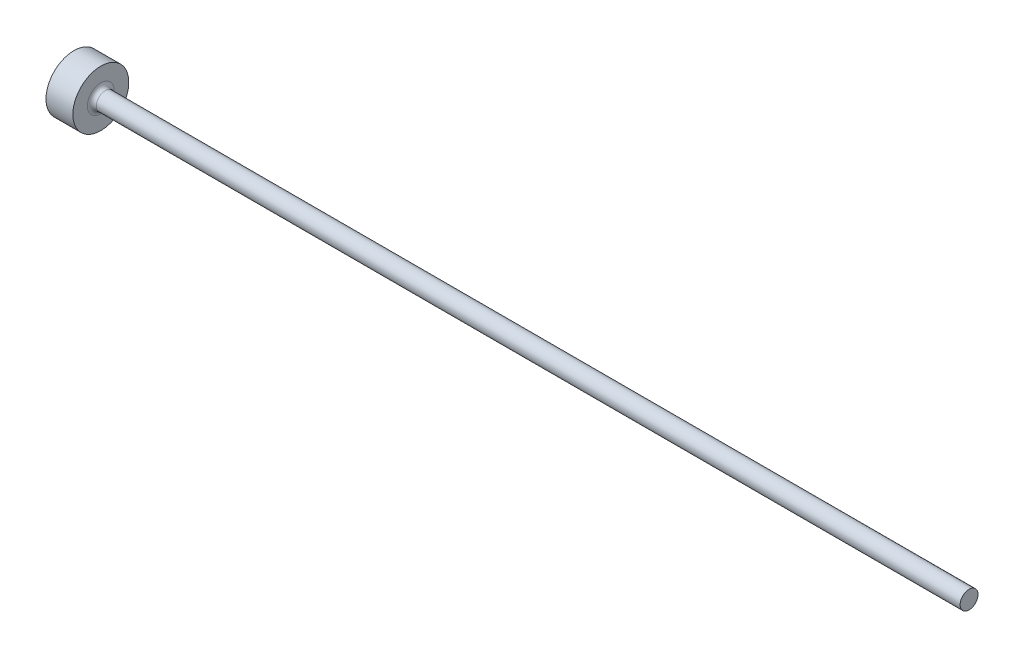
ISO-10303-21;
HEADER;
FILE_DESCRIPTION(('STEP AP214'),'2;1');
FILE_NAME('part.step','',(''),(''),'','','');
FILE_SCHEMA(('AUTOMOTIVE_DESIGN { 1 0 10303 214 1 1 1 1 }'));
ENDSEC;
DATA;
#1=APPLICATION_CONTEXT('core data for automotive mechanical design processes');
#2=APPLICATION_PROTOCOL_DEFINITION('international standard','automotive_design',2000,#1);
#3=PRODUCT_CONTEXT('',#1,'mechanical');
#4=PRODUCT('Part','Part','',(#3));
#5=PRODUCT_RELATED_PRODUCT_CATEGORY('part','',(#4));
#6=PRODUCT_DEFINITION_FORMATION('','',#4);
#7=PRODUCT_DEFINITION_CONTEXT('part definition',#1,'design');
#8=PRODUCT_DEFINITION('design','',#6,#7);
#9=PRODUCT_DEFINITION_SHAPE('','',#8);
#10=(LENGTH_UNIT() NAMED_UNIT(*) SI_UNIT(.MILLI.,.METRE.));
#11=(NAMED_UNIT(*) PLANE_ANGLE_UNIT() SI_UNIT($,.RADIAN.));
#12=(NAMED_UNIT(*) SI_UNIT($,.STERADIAN.) SOLID_ANGLE_UNIT());
#13=UNCERTAINTY_MEASURE_WITH_UNIT(LENGTH_MEASURE(1.E-05),#10,'distance_accuracy_value','');
#14=(GEOMETRIC_REPRESENTATION_CONTEXT(3) GLOBAL_UNCERTAINTY_ASSIGNED_CONTEXT((#13)) GLOBAL_UNIT_ASSIGNED_CONTEXT((#10,
#11,#12)) REPRESENTATION_CONTEXT('',''));
#15=CARTESIAN_POINT('',(0.,0.,0.));
#16=DIRECTION('',(0.,0.,1.));
#17=DIRECTION('',(1.,0.,0.));
#18=AXIS2_PLACEMENT_3D('',#15,#16,#17);
#19=CARTESIAN_POINT('',(40.,0.4,0.));
#20=DIRECTION('',(-1.,0.,0.));
#21=DIRECTION('',(0.,0.,1.));
#22=AXIS2_PLACEMENT_3D('',#19,#20,#21);
#23=PLANE('',#22);
#24=CARTESIAN_POINT('',(40.,0.,0.));
#25=DIRECTION('',(-1.,0.,0.));
#26=DIRECTION('',(0.,0.,1.));
#27=AXIS2_PLACEMENT_3D('',#24,#25,#26);
#28=CIRCLE('',#27,0.4);
#29=CARTESIAN_POINT('',(40.,0.,0.4));
#30=VERTEX_POINT('',#29);
#31=EDGE_CURVE('E10',#30,#30,#28,.T.);
#32=ORIENTED_EDGE('',*,*,#31,.F.);
#33=EDGE_LOOP('',(#32));
#34=FACE_BOUND('',#33,.T.);
#35=ADVANCED_FACE('F32',(#34),#23,.F.);
#36=CARTESIAN_POINT('',(0.,0.,0.));
#37=DIRECTION('',(-1.,0.,0.));
#38=DIRECTION('',(0.,0.,1.));
#39=AXIS2_PLACEMENT_3D('',#36,#37,#38);
#40=CYLINDRICAL_SURFACE('',#39,0.400000000000001);
#41=CARTESIAN_POINT('',(1.4,0.,0.));
#42=DIRECTION('',(-1.,0.,0.));
#43=DIRECTION('',(0.,0.,1.));
#44=AXIS2_PLACEMENT_3D('',#41,#42,#43);
#45=CIRCLE('',#44,0.400000000000002);
#46=CARTESIAN_POINT('',(1.4,0.,0.400000000000002));
#47=VERTEX_POINT('',#46);
#48=EDGE_CURVE('E38',#47,#47,#45,.T.);
#49=ORIENTED_EDGE('',*,*,#48,.F.);
#50=EDGE_LOOP('',(#49));
#51=FACE_BOUND('',#50,.T.);
#52=ORIENTED_EDGE('',*,*,#31,.T.);
#53=EDGE_LOOP('',(#52));
#54=FACE_BOUND('',#53,.T.);
#55=ADVANCED_FACE('F71',(#51,#54),#40,.T.);
#56=CARTESIAN_POINT('',(1.4,0.,0.));
#57=DIRECTION('',(-1.,0.,0.));
#58=DIRECTION('',(0.,0.,1.));
#59=AXIS2_PLACEMENT_3D('',#56,#57,#58);
#60=TOROIDAL_SURFACE('',#59,0.600000000000003,0.200000000000001);
#61=CARTESIAN_POINT('',(1.2,0.,0.));
#62=DIRECTION('',(-1.,0.,0.));
#63=DIRECTION('',(0.,0.,1.));
#64=AXIS2_PLACEMENT_3D('',#61,#62,#63);
#65=CIRCLE('',#64,0.600000000000003);
#66=CARTESIAN_POINT('',(1.2,0.,0.600000000000003));
#67=VERTEX_POINT('',#66);
#68=EDGE_CURVE('E42',#67,#67,#65,.T.);
#69=ORIENTED_EDGE('',*,*,#68,.F.);
#70=EDGE_LOOP('',(#69));
#71=FACE_BOUND('',#70,.T.);
#72=ORIENTED_EDGE('',*,*,#48,.T.);
#73=EDGE_LOOP('',(#72));
#74=FACE_BOUND('',#73,.T.);
#75=ADVANCED_FACE('F66',(#71,#74),#60,.F.);
#76=CARTESIAN_POINT('',(1.2,1.25,0.));
#77=DIRECTION('',(-1.,0.,0.));
#78=DIRECTION('',(0.,0.,1.));
#79=AXIS2_PLACEMENT_3D('',#76,#77,#78);
#80=PLANE('',#79);
#81=CARTESIAN_POINT('',(1.2,0.,0.));
#82=DIRECTION('',(-1.,0.,0.));
#83=DIRECTION('',(0.,0.,1.));
#84=AXIS2_PLACEMENT_3D('',#81,#82,#83);
#85=CIRCLE('',#84,1.25);
#86=CARTESIAN_POINT('',(1.2,0.,1.25));
#87=VERTEX_POINT('',#86);
#88=EDGE_CURVE('E46',#87,#87,#85,.T.);
#89=ORIENTED_EDGE('',*,*,#88,.F.);
#90=EDGE_LOOP('',(#89));
#91=FACE_BOUND('',#90,.T.);
#92=ORIENTED_EDGE('',*,*,#68,.T.);
#93=EDGE_LOOP('',(#92));
#94=FACE_BOUND('',#93,.T.);
#95=ADVANCED_FACE('F60',(#91,#94),#80,.F.);
#96=CARTESIAN_POINT('',(0.,0.,0.));
#97=DIRECTION('',(-1.,0.,0.));
#98=DIRECTION('',(0.,0.,1.));
#99=AXIS2_PLACEMENT_3D('',#96,#97,#98);
#100=CYLINDRICAL_SURFACE('',#99,1.25);
#101=CARTESIAN_POINT('',(0.,0.,0.));
#102=DIRECTION('',(-1.,0.,0.));
#103=DIRECTION('',(0.,0.,1.));
#104=AXIS2_PLACEMENT_3D('',#101,#102,#103);
#105=CIRCLE('',#104,1.25);
#106=CARTESIAN_POINT('',(0.,0.,1.25));
#107=VERTEX_POINT('',#106);
#108=EDGE_CURVE('E51',#107,#107,#105,.T.);
#109=ORIENTED_EDGE('',*,*,#108,.F.);
#110=EDGE_LOOP('',(#109));
#111=FACE_BOUND('',#110,.T.);
#112=ORIENTED_EDGE('',*,*,#88,.T.);
#113=EDGE_LOOP('',(#112));
#114=FACE_BOUND('',#113,.T.);
#115=ADVANCED_FACE('F57',(#111,#114),#100,.T.);
#116=CARTESIAN_POINT('',(0.,0.,0.));
#117=DIRECTION('',(1.,0.,0.));
#118=DIRECTION('',(0.,0.,-1.));
#119=AXIS2_PLACEMENT_3D('',#116,#117,#118);
#120=PLANE('',#119);
#121=ORIENTED_EDGE('',*,*,#108,.T.);
#122=EDGE_LOOP('',(#121));
#123=FACE_BOUND('',#122,.T.);
#124=ADVANCED_FACE('F55',(#123),#120,.F.);
#125=CLOSED_SHELL('',(#35,#55,#75,#95,#115,#124));
#126=MANIFOLD_SOLID_BREP('B2',#125);
#127=ADVANCED_BREP_SHAPE_REPRESENTATION('',(#18,#126),#14);
#128=SHAPE_DEFINITION_REPRESENTATION(#9,#127);
ENDSEC;
END-ISO-10303-21;
